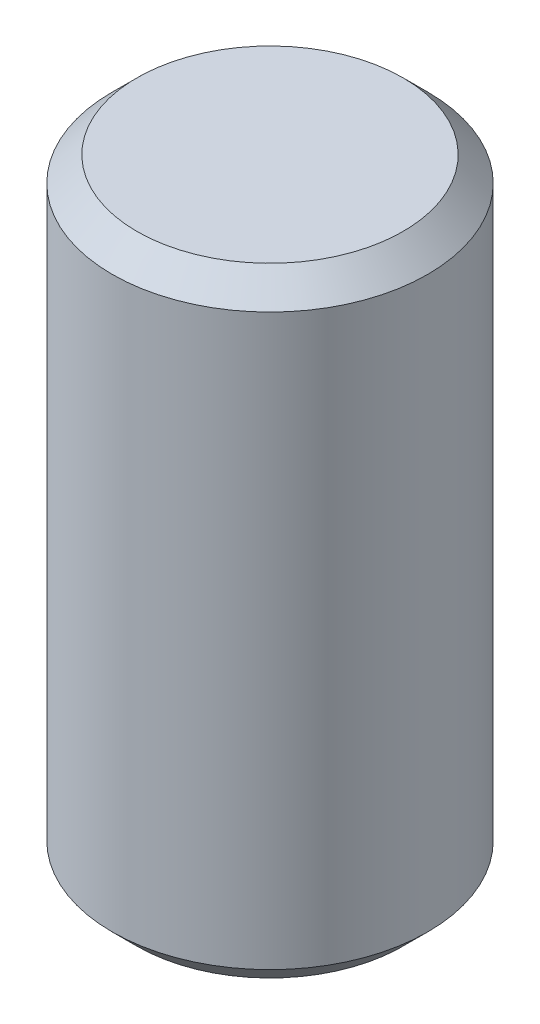
ISO-10303-21;
HEADER;
FILE_DESCRIPTION(('STEP AP214'),'2;1');
FILE_NAME('part.step','',(''),(''),'','','');
FILE_SCHEMA(('AUTOMOTIVE_DESIGN { 1 0 10303 214 1 1 1 1 }'));
ENDSEC;
DATA;
#1=APPLICATION_CONTEXT('core data for automotive mechanical design processes');
#2=APPLICATION_PROTOCOL_DEFINITION('international standard','automotive_design',2000,#1);
#3=PRODUCT_CONTEXT('',#1,'mechanical');
#4=PRODUCT('Part','Part','',(#3));
#5=PRODUCT_RELATED_PRODUCT_CATEGORY('part','',(#4));
#6=PRODUCT_DEFINITION_FORMATION('','',#4);
#7=PRODUCT_DEFINITION_CONTEXT('part definition',#1,'design');
#8=PRODUCT_DEFINITION('design','',#6,#7);
#9=PRODUCT_DEFINITION_SHAPE('','',#8);
#10=(LENGTH_UNIT() NAMED_UNIT(*) SI_UNIT(.MILLI.,.METRE.));
#11=(NAMED_UNIT(*) PLANE_ANGLE_UNIT() SI_UNIT($,.RADIAN.));
#12=(NAMED_UNIT(*) SI_UNIT($,.STERADIAN.) SOLID_ANGLE_UNIT());
#13=UNCERTAINTY_MEASURE_WITH_UNIT(LENGTH_MEASURE(1.E-05),#10,'distance_accuracy_value','');
#14=(GEOMETRIC_REPRESENTATION_CONTEXT(3) GLOBAL_UNCERTAINTY_ASSIGNED_CONTEXT((#13)) GLOBAL_UNIT_ASSIGNED_CONTEXT((#10,
#11,#12)) REPRESENTATION_CONTEXT('',''));
#15=CARTESIAN_POINT('',(0.,0.,0.));
#16=DIRECTION('',(0.,0.,1.));
#17=DIRECTION('',(1.,0.,0.));
#18=AXIS2_PLACEMENT_3D('',#15,#16,#17);
#19=CARTESIAN_POINT('',(0.,-6.35,0.));
#20=DIRECTION('',(0.,1.,0.));
#21=DIRECTION('',(0.,0.,1.));
#22=AXIS2_PLACEMENT_3D('',#19,#20,#21);
#23=PLANE('',#22);
#24=CARTESIAN_POINT('',(0.,-6.35,0.));
#25=DIRECTION('',(0.,1.,0.));
#26=DIRECTION('',(0.,0.,1.));
#27=AXIS2_PLACEMENT_3D('',#24,#25,#26);
#28=CIRCLE('',#27,2.7305);
#29=CARTESIAN_POINT('',(0.,-6.35,2.7305));
#30=VERTEX_POINT('',#29);
#31=EDGE_CURVE('E38',#30,#30,#28,.F.);
#32=ORIENTED_EDGE('',*,*,#31,.T.);
#33=EDGE_LOOP('',(#32));
#34=FACE_BOUND('',#33,.T.);
#35=ADVANCED_FACE('F31',(#34),#23,.F.);
#36=CARTESIAN_POINT('',(0.,6.08020788678209,0.));
#37=DIRECTION('',(0.,1.,0.));
#38=DIRECTION('',(0.,0.,1.));
#39=AXIS2_PLACEMENT_3D('',#36,#37,#38);
#40=CYLINDRICAL_SURFACE('',#39,3.2385);
#41=CARTESIAN_POINT('',(0.,-5.842,0.));
#42=DIRECTION('',(0.,1.,0.));
#43=DIRECTION('',(0.,0.,1.));
#44=AXIS2_PLACEMENT_3D('',#41,#42,#43);
#45=CIRCLE('',#44,3.2385);
#46=CARTESIAN_POINT('',(0.,-5.842,3.2385));
#47=VERTEX_POINT('',#46);
#48=EDGE_CURVE('E42',#47,#47,#45,.T.);
#49=ORIENTED_EDGE('',*,*,#48,.T.);
#50=EDGE_LOOP('',(#49));
#51=FACE_BOUND('',#50,.T.);
#52=CARTESIAN_POINT('',(0.,5.842,0.));
#53=DIRECTION('',(0.,-1.,0.));
#54=DIRECTION('',(0.,0.,-1.));
#55=AXIS2_PLACEMENT_3D('',#52,#53,#54);
#56=CIRCLE('',#55,3.2385);
#57=CARTESIAN_POINT('',(0.,5.842,-3.2385));
#58=VERTEX_POINT('',#57);
#59=EDGE_CURVE('E46',#58,#58,#56,.T.);
#60=ORIENTED_EDGE('',*,*,#59,.T.);
#61=EDGE_LOOP('',(#60));
#62=FACE_BOUND('',#61,.T.);
#63=ADVANCED_FACE('F52',(#51,#62),#40,.T.);
#64=CARTESIAN_POINT('',(3.2385,6.35,0.));
#65=DIRECTION('',(0.,-1.,0.));
#66=DIRECTION('',(0.,0.,-1.));
#67=AXIS2_PLACEMENT_3D('',#64,#65,#66);
#68=PLANE('',#67);
#69=CARTESIAN_POINT('',(0.,6.35,0.));
#70=DIRECTION('',(0.,-1.,0.));
#71=DIRECTION('',(0.,0.,-1.));
#72=AXIS2_PLACEMENT_3D('',#69,#70,#71);
#73=CIRCLE('',#72,2.7305);
#74=CARTESIAN_POINT('',(0.,6.35,-2.7305));
#75=VERTEX_POINT('',#74);
#76=EDGE_CURVE('E10',#75,#75,#73,.F.);
#77=ORIENTED_EDGE('',*,*,#76,.T.);
#78=EDGE_LOOP('',(#77));
#79=FACE_BOUND('',#78,.T.);
#80=ADVANCED_FACE('F60',(#79),#68,.F.);
#81=CARTESIAN_POINT('',(0.,-5.842,0.));
#82=DIRECTION('',(0.,1.,0.));
#83=DIRECTION('',(0.,0.,1.));
#84=AXIS2_PLACEMENT_3D('',#81,#82,#83);
#85=CONICAL_SURFACE('',#84,3.2385,0.785398163397449);
#86=ORIENTED_EDGE('',*,*,#31,.F.);
#87=EDGE_LOOP('',(#86));
#88=FACE_BOUND('',#87,.T.);
#89=ORIENTED_EDGE('',*,*,#48,.F.);
#90=EDGE_LOOP('',(#89));
#91=FACE_BOUND('',#90,.T.);
#92=ADVANCED_FACE('F56',(#88,#91),#85,.T.);
#93=CARTESIAN_POINT('',(0.,6.35,0.));
#94=DIRECTION('',(0.,-1.,0.));
#95=DIRECTION('',(0.,0.,-1.));
#96=AXIS2_PLACEMENT_3D('',#93,#94,#95);
#97=CONICAL_SURFACE('',#96,2.7305,0.785398163397448);
#98=ORIENTED_EDGE('',*,*,#59,.F.);
#99=EDGE_LOOP('',(#98));
#100=FACE_BOUND('',#99,.T.);
#101=ORIENTED_EDGE('',*,*,#76,.F.);
#102=EDGE_LOOP('',(#101));
#103=FACE_BOUND('',#102,.T.);
#104=ADVANCED_FACE('F33',(#100,#103),#97,.T.);
#105=CLOSED_SHELL('',(#35,#63,#80,#92,#104));
#106=MANIFOLD_SOLID_BREP('B2',#105);
#107=ADVANCED_BREP_SHAPE_REPRESENTATION('',(#18,#106),#14);
#108=SHAPE_DEFINITION_REPRESENTATION(#9,#107);
ENDSEC;
END-ISO-10303-21;
